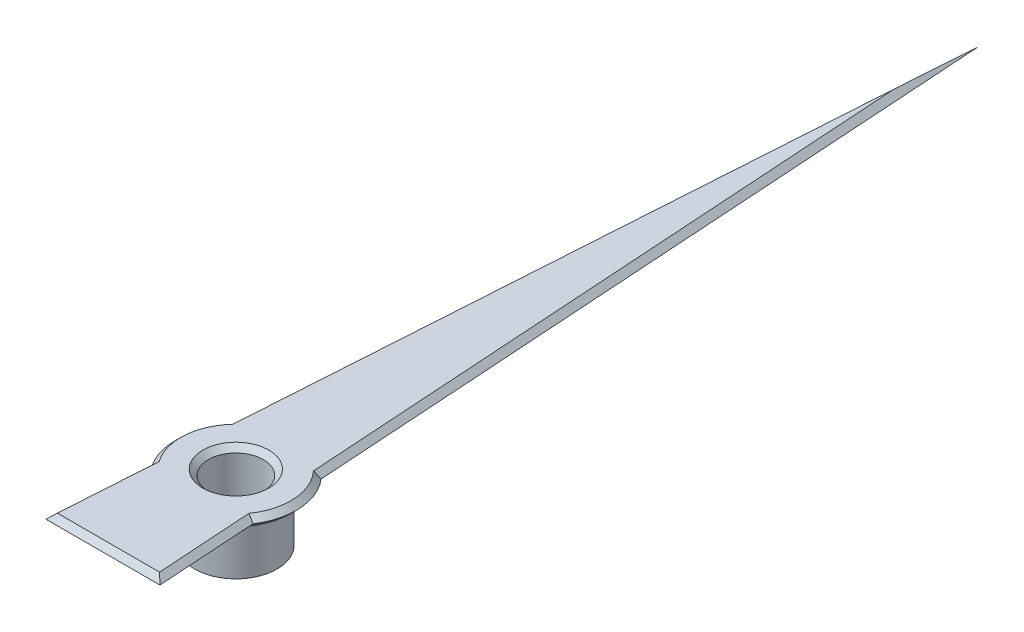
ISO-10303-21;
HEADER;
FILE_DESCRIPTION(('STEP AP214'),'2;1');
FILE_NAME('part.step','',(''),(''),'','','');
FILE_SCHEMA(('AUTOMOTIVE_DESIGN { 1 0 10303 214 1 1 1 1 }'));
ENDSEC;
DATA;
#1=APPLICATION_CONTEXT('core data for automotive mechanical design processes');
#2=APPLICATION_PROTOCOL_DEFINITION('international standard','automotive_design',2000,#1);
#3=PRODUCT_CONTEXT('',#1,'mechanical');
#4=PRODUCT('Part','Part','',(#3));
#5=PRODUCT_RELATED_PRODUCT_CATEGORY('part','',(#4));
#6=PRODUCT_DEFINITION_FORMATION('','',#4);
#7=PRODUCT_DEFINITION_CONTEXT('part definition',#1,'design');
#8=PRODUCT_DEFINITION('design','',#6,#7);
#9=PRODUCT_DEFINITION_SHAPE('','',#8);
#10=(LENGTH_UNIT() NAMED_UNIT(*) SI_UNIT(.MILLI.,.METRE.));
#11=(NAMED_UNIT(*) PLANE_ANGLE_UNIT() SI_UNIT($,.RADIAN.));
#12=(NAMED_UNIT(*) SI_UNIT($,.STERADIAN.) SOLID_ANGLE_UNIT());
#13=UNCERTAINTY_MEASURE_WITH_UNIT(LENGTH_MEASURE(1.E-05),#10,'distance_accuracy_value','');
#14=(GEOMETRIC_REPRESENTATION_CONTEXT(3) GLOBAL_UNCERTAINTY_ASSIGNED_CONTEXT((#13)) GLOBAL_UNIT_ASSIGNED_CONTEXT((#10,
#11,#12)) REPRESENTATION_CONTEXT('',''));
#15=CARTESIAN_POINT('',(0.,0.,0.));
#16=DIRECTION('',(0.,0.,1.));
#17=DIRECTION('',(1.,0.,0.));
#18=AXIS2_PLACEMENT_3D('',#15,#16,#17);
#19=CARTESIAN_POINT('',(0.,-1.,0.));
#20=DIRECTION('',(0.,1.,0.));
#21=DIRECTION('',(0.,0.,1.));
#22=AXIS2_PLACEMENT_3D('',#19,#20,#21);
#23=CYLINDRICAL_SURFACE('',#22,0.75);
#24=CARTESIAN_POINT('',(0.,-0.1,0.));
#25=DIRECTION('',(0.,1.,0.));
#26=DIRECTION('',(0.,0.,1.));
#27=AXIS2_PLACEMENT_3D('',#24,#25,#26);
#28=CIRCLE('',#27,0.75);
#29=CARTESIAN_POINT('',(0.,-0.1,0.75));
#30=VERTEX_POINT('',#29);
#31=EDGE_CURVE('E304',#30,#30,#28,.F.);
#32=ORIENTED_EDGE('',*,*,#31,.T.);
#33=EDGE_LOOP('',(#32));
#34=FACE_BOUND('',#33,.T.);
#35=CARTESIAN_POINT('',(0.,-1.,0.));
#36=DIRECTION('',(0.,1.,0.));
#37=DIRECTION('',(0.,0.,1.));
#38=AXIS2_PLACEMENT_3D('',#35,#36,#37);
#39=CIRCLE('',#38,0.75);
#40=CARTESIAN_POINT('',(0.,-1.,0.75));
#41=VERTEX_POINT('',#40);
#42=EDGE_CURVE('E327',#41,#41,#39,.T.);
#43=ORIENTED_EDGE('',*,*,#42,.T.);
#44=EDGE_LOOP('',(#43));
#45=FACE_BOUND('',#44,.T.);
#46=ADVANCED_FACE('F34',(#34,#45),#23,.T.);
#47=CARTESIAN_POINT('',(0.,-1.,0.));
#48=DIRECTION('',(0.,1.,0.));
#49=DIRECTION('',(0.,0.,1.));
#50=AXIS2_PLACEMENT_3D('',#47,#48,#49);
#51=PLANE('',#50);
#52=ORIENTED_EDGE('',*,*,#42,.F.);
#53=EDGE_LOOP('',(#52));
#54=FACE_BOUND('',#53,.T.);
#55=ADVANCED_FACE('F178',(#54),#51,.F.);
#56=CARTESIAN_POINT('',(0.,0.2,0.));
#57=DIRECTION('',(0.,1.,0.));
#58=DIRECTION('',(0.,0.,1.));
#59=AXIS2_PLACEMENT_3D('',#56,#57,#58);
#60=PLANE('',#59);
#61=DIRECTION('',(-0.0649705239479234,0.,-0.997887183512211));
#62=VECTOR('',#61,1.);
#63=CARTESIAN_POINT('',(0.77546019922381,0.2,-0.0504887288631216));
#64=LINE('',#63,#62);
#65=CARTESIAN_POINT('',(0.734569402706049,0.2,-0.678533560413986));
#66=VERTEX_POINT('',#65);
#67=CARTESIAN_POINT('',(0.,0.2,-11.9608404869853));
#68=VERTEX_POINT('',#67);
#69=EDGE_CURVE('E57',#66,#68,#64,.T.);
#70=ORIENTED_EDGE('',*,*,#69,.T.);
#71=DIRECTION('',(-0.0649705239479234,0.,0.997887183512211));
#72=VECTOR('',#71,1.);
#73=CARTESIAN_POINT('',(-0.77546019922381,0.2,-0.0504887288631216));
#74=LINE('',#73,#72);
#75=CARTESIAN_POINT('',(-0.734569402706049,0.2,-0.678533560413986));
#76=VERTEX_POINT('',#75);
#77=EDGE_CURVE('E48',#68,#76,#74,.T.);
#78=ORIENTED_EDGE('',*,*,#77,.T.);
#79=CARTESIAN_POINT('',(0.,0.2,0.));
#80=DIRECTION('',(0.,1.,0.));
#81=DIRECTION('',(0.,0.,1.));
#82=AXIS2_PLACEMENT_3D('',#79,#80,#81);
#83=CIRCLE('',#82,1.);
#84=CARTESIAN_POINT('',(-0.816350995741502,0.2,0.577556102687748));
#85=VERTEX_POINT('',#84);
#86=EDGE_CURVE('E309',#76,#85,#83,.T.);
#87=ORIENTED_EDGE('',*,*,#86,.T.);
#88=DIRECTION('',(-0.0649705239479234,0.,0.997887183512211));
#89=VECTOR('',#88,1.);
#90=CARTESIAN_POINT('',(-0.77546019922381,0.2,-0.0504887288631216));
#91=LINE('',#90,#89);
#92=CARTESIAN_POINT('',(-0.92957833560792,0.2,2.31662336596562));
#93=VERTEX_POINT('',#92);
#94=EDGE_CURVE('E311',#85,#93,#91,.T.);
#95=ORIENTED_EDGE('',*,*,#94,.T.);
#96=DIRECTION('',(1.,0.,0.));
#97=VECTOR('',#96,1.);
#98=CARTESIAN_POINT('',(0.,0.2,2.31662336596562));
#99=LINE('',#98,#97);
#100=CARTESIAN_POINT('',(0.92957833560792,0.2,2.31662336596562));
#101=VERTEX_POINT('',#100);
#102=EDGE_CURVE('E132',#93,#101,#99,.T.);
#103=ORIENTED_EDGE('',*,*,#102,.T.);
#104=DIRECTION('',(-0.0649705239479234,0.,-0.997887183512211));
#105=VECTOR('',#104,1.);
#106=CARTESIAN_POINT('',(0.77546019922381,0.2,-0.0504887288631216));
#107=LINE('',#106,#105);
#108=CARTESIAN_POINT('',(0.816350995741537,0.2,0.577556102687746));
#109=VERTEX_POINT('',#108);
#110=EDGE_CURVE('E126',#101,#109,#107,.T.);
#111=ORIENTED_EDGE('',*,*,#110,.T.);
#112=CARTESIAN_POINT('',(0.,0.2,0.));
#113=DIRECTION('',(0.,1.,0.));
#114=DIRECTION('',(0.,0.,1.));
#115=AXIS2_PLACEMENT_3D('',#112,#113,#114);
#116=CIRCLE('',#115,1.);
#117=EDGE_CURVE('E130',#109,#66,#116,.T.);
#118=ORIENTED_EDGE('',*,*,#117,.T.);
#119=EDGE_LOOP('',(#70,#78,#87,#95,#103,#111,#118));
#120=FACE_BOUND('',#119,.T.);
#121=CARTESIAN_POINT('',(0.,0.2,0.));
#122=DIRECTION('',(0.,1.,0.));
#123=DIRECTION('',(0.,0.,1.));
#124=AXIS2_PLACEMENT_3D('',#121,#122,#123);
#125=CIRCLE('',#124,0.600000000000005);
#126=CARTESIAN_POINT('',(0.,0.2,0.600000000000005));
#127=VERTEX_POINT('',#126);
#128=EDGE_CURVE('E306',#127,#127,#125,.F.);
#129=ORIENTED_EDGE('',*,*,#128,.T.);
#130=EDGE_LOOP('',(#129));
#131=FACE_BOUND('',#130,.T.);
#132=ADVANCED_FACE('F128',(#120,#131),#60,.T.);
#133=CARTESIAN_POINT('',(0.,0.,0.));
#134=DIRECTION('',(0.,1.,0.));
#135=DIRECTION('',(0.,0.,1.));
#136=AXIS2_PLACEMENT_3D('',#133,#134,#135);
#137=PLANE('',#136);
#138=CARTESIAN_POINT('',(0.,0.,0.));
#139=DIRECTION('',(0.,1.,0.));
#140=DIRECTION('',(0.,0.,1.));
#141=AXIS2_PLACEMENT_3D('',#138,#139,#140);
#142=CIRCLE('',#141,0.850000000000002);
#143=CARTESIAN_POINT('',(0.,0.,0.850000000000002));
#144=VERTEX_POINT('',#143);
#145=EDGE_CURVE('E301',#144,#144,#142,.T.);
#146=ORIENTED_EDGE('',*,*,#145,.T.);
#147=EDGE_LOOP('',(#146));
#148=FACE_BOUND('',#147,.T.);
#149=DIRECTION('',(-1.,0.,0.));
#150=VECTOR('',#149,1.);
#151=CARTESIAN_POINT('',(-1.03630087313963,0.,2.31662336596562));
#152=LINE('',#151,#150);
#153=CARTESIAN_POINT('',(0.929578335607919,0.,2.31662336596562));
#154=VERTEX_POINT('',#153);
#155=CARTESIAN_POINT('',(-0.929578335607919,0.,2.31662336596562));
#156=VERTEX_POINT('',#155);
#157=EDGE_CURVE('E286',#154,#156,#152,.T.);
#158=ORIENTED_EDGE('',*,*,#157,.T.);
#159=DIRECTION('',(0.0649705239479234,0.,-0.997887183512211));
#160=VECTOR('',#159,1.);
#161=CARTESIAN_POINT('',(-0.818590643259629,0.,0.611955018043307));
#162=LINE('',#161,#160);
#163=CARTESIAN_POINT('',(-0.816350995741501,0.,0.577556102687747));
#164=VERTEX_POINT('',#163);
#165=EDGE_CURVE('E293',#156,#164,#162,.T.);
#166=ORIENTED_EDGE('',*,*,#165,.T.);
#167=CARTESIAN_POINT('',(0.,0.,0.));
#168=DIRECTION('',(0.,1.,0.));
#169=DIRECTION('',(0.,0.,1.));
#170=AXIS2_PLACEMENT_3D('',#167,#168,#169);
#171=CIRCLE('',#170,1.);
#172=CARTESIAN_POINT('',(-0.734569402706048,0.,-0.678533560413986));
#173=VERTEX_POINT('',#172);
#174=EDGE_CURVE('E323',#164,#173,#171,.F.);
#175=ORIENTED_EDGE('',*,*,#174,.T.);
#176=DIRECTION('',(0.0649705239479234,0.,-0.997887183512211));
#177=VECTOR('',#176,1.);
#178=CARTESIAN_POINT('',(0.0997887183512213,0.,-13.4935029476052));
#179=LINE('',#178,#177);
#180=CARTESIAN_POINT('',(0.,0.,-11.9608404869852));
#181=VERTEX_POINT('',#180);
#182=EDGE_CURVE('E326',#173,#181,#179,.T.);
#183=ORIENTED_EDGE('',*,*,#182,.T.);
#184=DIRECTION('',(0.0649705239479234,0.,0.997887183512211));
#185=VECTOR('',#184,1.);
#186=CARTESIAN_POINT('',(0.732329755187987,0.,-0.712932475769563));
#187=LINE('',#186,#185);
#188=CARTESIAN_POINT('',(0.734569402706082,0.,-0.678533560413988));
#189=VERTEX_POINT('',#188);
#190=EDGE_CURVE('E295',#181,#189,#187,.T.);
#191=ORIENTED_EDGE('',*,*,#190,.T.);
#192=CARTESIAN_POINT('',(0.,0.,0.));
#193=DIRECTION('',(0.,1.,0.));
#194=DIRECTION('',(0.,0.,1.));
#195=AXIS2_PLACEMENT_3D('',#192,#193,#194);
#196=CIRCLE('',#195,1.);
#197=CARTESIAN_POINT('',(0.816350995741501,0.,0.577556102687747));
#198=VERTEX_POINT('',#197);
#199=EDGE_CURVE('E291',#189,#198,#196,.F.);
#200=ORIENTED_EDGE('',*,*,#199,.T.);
#201=DIRECTION('',(0.0649705239479234,0.,0.997887183512211));
#202=VECTOR('',#201,1.);
#203=CARTESIAN_POINT('',(0.936512154788406,0.,2.42312041836042));
#204=LINE('',#203,#202);
#205=EDGE_CURVE('E288',#198,#154,#204,.T.);
#206=ORIENTED_EDGE('',*,*,#205,.T.);
#207=EDGE_LOOP('',(#158,#166,#175,#183,#191,#200,#206));
#208=FACE_BOUND('',#207,.T.);
#209=ADVANCED_FACE('F329',(#148,#208),#137,.F.);
#210=CARTESIAN_POINT('',(0.,-0.8,0.));
#211=DIRECTION('',(0.,1.,0.));
#212=DIRECTION('',(0.,0.,1.));
#213=AXIS2_PLACEMENT_3D('',#210,#211,#212);
#214=CYLINDRICAL_SURFACE('',#213,0.5);
#215=CARTESIAN_POINT('',(0.,0.0999999999999967,0.));
#216=DIRECTION('',(0.,1.,0.));
#217=DIRECTION('',(0.,0.,1.));
#218=AXIS2_PLACEMENT_3D('',#215,#216,#217);
#219=CIRCLE('',#218,0.5);
#220=CARTESIAN_POINT('',(0.,0.0999999999999967,0.5));
#221=VERTEX_POINT('',#220);
#222=EDGE_CURVE('E11',#221,#221,#219,.T.);
#223=ORIENTED_EDGE('',*,*,#222,.T.);
#224=EDGE_LOOP('',(#223));
#225=FACE_BOUND('',#224,.T.);
#226=CARTESIAN_POINT('',(0.,-0.8,0.));
#227=DIRECTION('',(0.,1.,0.));
#228=DIRECTION('',(0.,0.,1.));
#229=AXIS2_PLACEMENT_3D('',#226,#227,#228);
#230=CIRCLE('',#229,0.5);
#231=CARTESIAN_POINT('',(0.,-0.8,0.5));
#232=VERTEX_POINT('',#231);
#233=EDGE_CURVE('E347',#232,#232,#230,.T.);
#234=ORIENTED_EDGE('',*,*,#233,.F.);
#235=EDGE_LOOP('',(#234));
#236=FACE_BOUND('',#235,.T.);
#237=ADVANCED_FACE('F331',(#225,#236),#214,.F.);
#238=CARTESIAN_POINT('',(0.,-0.8,0.));
#239=DIRECTION('',(0.,1.,0.));
#240=DIRECTION('',(0.,0.,1.));
#241=AXIS2_PLACEMENT_3D('',#238,#239,#240);
#242=PLANE('',#241);
#243=ORIENTED_EDGE('',*,*,#233,.T.);
#244=EDGE_LOOP('',(#243));
#245=FACE_BOUND('',#244,.T.);
#246=ADVANCED_FACE('F174',(#245),#242,.T.);
#247=CARTESIAN_POINT('',(0.,0.,0.));
#248=DIRECTION('',(0.,1.,0.));
#249=DIRECTION('',(0.,0.,1.));
#250=AXIS2_PLACEMENT_3D('',#247,#248,#249);
#251=CONICAL_SURFACE('',#250,0.850000000000002,0.785398163397455);
#252=ORIENTED_EDGE('',*,*,#31,.F.);
#253=EDGE_LOOP('',(#252));
#254=FACE_BOUND('',#253,.T.);
#255=ORIENTED_EDGE('',*,*,#145,.F.);
#256=EDGE_LOOP('',(#255));
#257=FACE_BOUND('',#256,.T.);
#258=ADVANCED_FACE('F168',(#254,#257),#251,.T.);
#259=CARTESIAN_POINT('',(0.77546019922381,0.2,-0.0504887288631216));
#260=DIRECTION('',(-0.705612794320632,-0.707106781186544,0.0459410980608198));
#261=DIRECTION('',(0.707854168766259,-0.706358602807546,0.));
#262=AXIS2_PLACEMENT_3D('',#259,#260,#261);
#263=PLANE('',#262);
#264=DIRECTION('',(0.,0.0648338307695518,0.997896073941443));
#265=VECTOR('',#264,1.);
#266=CARTESIAN_POINT('',(0.,0.970569091780508,-0.100553006494177));
#267=LINE('',#266,#265);
#268=CARTESIAN_POINT('',(0.,0.100000000000001,-13.5));
#269=VERTEX_POINT('',#268);
#270=EDGE_CURVE('E148',#68,#269,#267,.F.);
#271=ORIENTED_EDGE('',*,*,#270,.F.);
#272=ORIENTED_EDGE('',*,*,#69,.F.);
#273=CARTESIAN_POINT('',(0.832118473539209,0.1,-0.719429528164349));
#274=CARTESIAN_POINT('',(0.815826053026441,0.116691570761109,-0.712756145887584));
#275=CARTESIAN_POINT('',(0.799550757166332,0.133370685749081,-0.706011458994636));
#276=CARTESIAN_POINT('',(0.767034400191282,0.166704019104725,-0.692379469872252));
#277=CARTESIAN_POINT('',(0.750793339107012,0.183358237450089,-0.685492167515101));
#278=CARTESIAN_POINT('',(0.734569402706073,0.200000000000006,-0.678533560414052));
#279=B_SPLINE_CURVE_WITH_KNOTS('',3,(#273,#274,#275,#276,#277,#278),.UNSPECIFIED.,.F.,.F.,(4,2,
4),(0.,0.0727813190358586,0.145562703251685),.UNSPECIFIED.);
#280=CARTESIAN_POINT('',(0.832118473539209,0.100000000000001,-0.719429528164349));
#281=VERTEX_POINT('',#280);
#282=EDGE_CURVE('E38',#281,#66,#279,.T.);
#283=ORIENTED_EDGE('',*,*,#282,.F.);
#284=DIRECTION('',(0.0649705239479234,0.,0.997887183512211));
#285=VECTOR('',#284,1.);
#286=CARTESIAN_POINT('',(0.,0.1,-13.5));
#287=LINE('',#286,#285);
#288=EDGE_CURVE('E82',#269,#281,#287,.T.);
#289=ORIENTED_EDGE('',*,*,#288,.F.);
#290=EDGE_LOOP('',(#271,#272,#283,#289));
#291=FACE_BOUND('',#290,.T.);
#292=ADVANCED_FACE('F165',(#291),#263,.F.);
#293=CARTESIAN_POINT('',(0.,0.2,0.));
#294=DIRECTION('',(0.,-1.,0.));
#295=DIRECTION('',(0.,0.,-1.));
#296=AXIS2_PLACEMENT_3D('',#293,#294,#295);
#297=CONICAL_SURFACE('',#296,1.,0.785398163397444);
#298=ORIENTED_EDGE('',*,*,#282,.T.);
#299=ORIENTED_EDGE('',*,*,#117,.F.);
#300=CARTESIAN_POINT('',(0.918379361610851,0.1,0.605457965648521));
#301=CARTESIAN_POINT('',(0.90135917305322,0.116691570761113,0.600953503567481));
#302=CARTESIAN_POINT('',(0.88434671875568,0.133370685749087,0.596376118354045));
#303=CARTESIAN_POINT('',(0.850337263452048,0.166704019104739,0.587075497497753));
#304=CARTESIAN_POINT('',(0.833340262459809,0.183358237450107,0.582352261724284));
#305=CARTESIAN_POINT('',(0.816350995741514,0.200000000000027,0.577556102687804));
#306=B_SPLINE_CURVE_WITH_KNOTS('',3,(#300,#301,#302,#303,#304,#305),.UNSPECIFIED.,.F.,.F.,(4,2,
4),(0.,0.0727813190358737,0.145562703251715),.UNSPECIFIED.);
#307=CARTESIAN_POINT('',(0.918379361610851,0.100000000000001,0.605457965648521));
#308=VERTEX_POINT('',#307);
#309=EDGE_CURVE('E140',#308,#109,#306,.T.);
#310=ORIENTED_EDGE('',*,*,#309,.F.);
#311=CARTESIAN_POINT('',(0.,0.1,0.));
#312=DIRECTION('',(0.,1.,0.));
#313=DIRECTION('',(0.,0.,1.));
#314=AXIS2_PLACEMENT_3D('',#311,#312,#313);
#315=CIRCLE('',#314,1.1);
#316=EDGE_CURVE('E149',#281,#308,#315,.F.);
#317=ORIENTED_EDGE('',*,*,#316,.F.);
#318=EDGE_LOOP('',(#298,#299,#310,#317));
#319=FACE_BOUND('',#318,.T.);
#320=ADVANCED_FACE('F138',(#319),#297,.T.);
#321=CARTESIAN_POINT('',(0.,0.100000000000001,-13.5));
#322=DIRECTION('',(0.70561279432063,-0.707106781186546,-0.0459410980608197));
#323=DIRECTION('',(0.707854168766261,0.706358602807544,0.));
#324=AXIS2_PLACEMENT_3D('',#321,#322,#323);
#325=PLANE('',#324);
#326=DIRECTION('',(0.,-0.0648338307695515,0.997896073941443));
#327=VECTOR('',#326,1.);
#328=CARTESIAN_POINT('',(0.,0.100000000000001,-13.5));
#329=LINE('',#328,#327);
#330=EDGE_CURVE('E262',#269,#181,#329,.T.);
#331=ORIENTED_EDGE('',*,*,#330,.F.);
#332=ORIENTED_EDGE('',*,*,#288,.T.);
#333=CARTESIAN_POINT('',(0.832118473539209,0.100000000000001,-0.719429528164349));
#334=CARTESIAN_POINT('',(0.815826053026437,0.0833084292388882,-0.712756145887582));
#335=CARTESIAN_POINT('',(0.799550757166325,0.0666293142509133,-0.706011458994633));
#336=CARTESIAN_POINT('',(0.767034400191267,0.033295980895261,-0.692379469872246));
#337=CARTESIAN_POINT('',(0.750793339106994,0.0166417625498936,-0.685492167515093));
#338=CARTESIAN_POINT('',(0.734569402706052,0.,-0.678533560414043));
#339=B_SPLINE_CURVE_WITH_KNOTS('',3,(#333,#334,#335,#336,#337,#338),.UNSPECIFIED.,.F.,.F.,(4,2,
4),(0.,0.0727813190358746,0.145562703251717),.UNSPECIFIED.);
#340=EDGE_CURVE('E152',#189,#281,#339,.F.);
#341=ORIENTED_EDGE('',*,*,#340,.F.);
#342=ORIENTED_EDGE('',*,*,#190,.F.);
#343=EDGE_LOOP('',(#331,#332,#341,#342));
#344=FACE_BOUND('',#343,.T.);
#345=ADVANCED_FACE('F173',(#344),#325,.T.);
#346=CARTESIAN_POINT('',(-0.77546019922381,0.2,-0.0504887288631216));
#347=DIRECTION('',(0.705612794320632,-0.707106781186544,0.0459410980608198));
#348=DIRECTION('',(0.707854168766259,0.706358602807546,0.));
#349=AXIS2_PLACEMENT_3D('',#346,#347,#348);
#350=PLANE('',#349);
#351=ORIENTED_EDGE('',*,*,#77,.F.);
#352=ORIENTED_EDGE('',*,*,#270,.T.);
#353=DIRECTION('',(0.0649705239479234,0.,-0.997887183512211));
#354=VECTOR('',#353,1.);
#355=CARTESIAN_POINT('',(0.,0.1,-13.5));
#356=LINE('',#355,#354);
#357=CARTESIAN_POINT('',(-0.832118473539209,0.100000000000001,-0.719429528164349));
#358=VERTEX_POINT('',#357);
#359=EDGE_CURVE('E246',#358,#269,#356,.T.);
#360=ORIENTED_EDGE('',*,*,#359,.F.);
#361=CARTESIAN_POINT('',(-0.734569402706082,0.2,-0.678533560414016));
#362=CARTESIAN_POINT('',(-0.750793339107021,0.183358237450083,-0.685492167515063));
#363=CARTESIAN_POINT('',(-0.767034400191287,0.166704019104721,-0.692379469872226));
#364=CARTESIAN_POINT('',(-0.799550757166326,0.133370685749086,-0.706011458994662));
#365=CARTESIAN_POINT('',(-0.815826053026425,0.116691570761121,-0.71275614588765));
#366=CARTESIAN_POINT('',(-0.832118473539179,0.100000000000022,-0.719429528164469));
#367=B_SPLINE_CURVE_WITH_KNOTS('',3,(#361,#362,#363,#364,#365,#366),.UNSPECIFIED.,.F.,.F.,(4,2,
4),(0.,0.0727813842158262,0.145562703251684),.UNSPECIFIED.);
#368=EDGE_CURVE('E238',#76,#358,#367,.T.);
#369=ORIENTED_EDGE('',*,*,#368,.F.);
#370=EDGE_LOOP('',(#351,#352,#360,#369));
#371=FACE_BOUND('',#370,.T.);
#372=ADVANCED_FACE('F164',(#371),#350,.F.);
#373=CARTESIAN_POINT('',(0.77546019922381,0.2,-0.0504887288631215));
#374=DIRECTION('',(-0.705612794320632,-0.707106781186545,0.0459410980608198));
#375=DIRECTION('',(0.70785416876626,-0.706358602807545,0.));
#376=AXIS2_PLACEMENT_3D('',#373,#374,#375);
#377=PLANE('',#376);
#378=ORIENTED_EDGE('',*,*,#309,.T.);
#379=ORIENTED_EDGE('',*,*,#110,.F.);
#380=DIRECTION('',(-0.602368926162997,0.564425228348823,-0.564425228348819));
#381=VECTOR('',#380,1.);
#382=CARTESIAN_POINT('',(0.592282395243253,0.51604940077859,2.00057396518704));
#383=LINE('',#382,#381);
#384=CARTESIAN_POINT('',(1.03630087313963,0.100000000000001,2.41662336596562));
#385=VERTEX_POINT('',#384);
#386=EDGE_CURVE('E247',#385,#101,#383,.T.);
#387=ORIENTED_EDGE('',*,*,#386,.F.);
#388=DIRECTION('',(0.0649705239479234,0.,0.997887183512211));
#389=VECTOR('',#388,1.);
#390=CARTESIAN_POINT('',(0.,0.1,-13.5));
#391=LINE('',#390,#389);
#392=EDGE_CURVE('E146',#308,#385,#391,.T.);
#393=ORIENTED_EDGE('',*,*,#392,.F.);
#394=EDGE_LOOP('',(#378,#379,#387,#393));
#395=FACE_BOUND('',#394,.T.);
#396=ADVANCED_FACE('F144',(#395),#377,.F.);
#397=CARTESIAN_POINT('',(0.,0.100000000000001,0.));
#398=DIRECTION('',(0.,1.,0.));
#399=DIRECTION('',(0.,0.,1.));
#400=AXIS2_PLACEMENT_3D('',#397,#398,#399);
#401=CONICAL_SURFACE('',#400,1.1,0.785398163397446);
#402=ORIENTED_EDGE('',*,*,#340,.T.);
#403=ORIENTED_EDGE('',*,*,#316,.T.);
#404=CARTESIAN_POINT('',(0.918379361610851,0.100000000000001,0.605457965648521));
#405=CARTESIAN_POINT('',(0.901359173053224,0.0833084292388917,0.600953503567482));
#406=CARTESIAN_POINT('',(0.884346718755686,0.0666293142509202,0.596376118354047));
#407=CARTESIAN_POINT('',(0.850337263452061,0.0332959808952748,0.587075497497756));
#408=CARTESIAN_POINT('',(0.833340262459826,0.0166417625499108,0.582352261724288));
#409=CARTESIAN_POINT('',(0.816350995741533,0.,0.577556102687809));
#410=B_SPLINE_CURVE_WITH_KNOTS('',3,(#404,#405,#406,#407,#408,#409),.UNSPECIFIED.,.F.,.F.,(4,2,
4),(0.,0.0727813190358595,0.145562703251687),.UNSPECIFIED.);
#411=EDGE_CURVE('E270',#198,#308,#410,.F.);
#412=ORIENTED_EDGE('',*,*,#411,.F.);
#413=ORIENTED_EDGE('',*,*,#199,.F.);
#414=EDGE_LOOP('',(#402,#403,#412,#413));
#415=FACE_BOUND('',#414,.T.);
#416=ADVANCED_FACE('F163',(#415),#401,.T.);
#417=CARTESIAN_POINT('',(0.,0.100000000000001,-13.5));
#418=DIRECTION('',(-0.70561279432063,-0.707106781186546,-0.0459410980608197));
#419=DIRECTION('',(0.707854168766261,-0.706358602807544,0.));
#420=AXIS2_PLACEMENT_3D('',#417,#418,#419);
#421=PLANE('',#420);
#422=ORIENTED_EDGE('',*,*,#330,.T.);
#423=ORIENTED_EDGE('',*,*,#182,.F.);
#424=CARTESIAN_POINT('',(-0.832118473539209,0.100000000000001,-0.719429528164349));
#425=CARTESIAN_POINT('',(-0.815826053026441,0.0833084292388917,-0.712756145887583));
#426=CARTESIAN_POINT('',(-0.799550757166332,0.0666293142509202,-0.706011458994635));
#427=CARTESIAN_POINT('',(-0.767034400191281,0.0332959808952748,-0.692379469872251));
#428=CARTESIAN_POINT('',(-0.750793339107011,0.0166417625499107,-0.6854921675151));
#429=CARTESIAN_POINT('',(-0.734569402706072,0.,-0.678533560414051));
#430=B_SPLINE_CURVE_WITH_KNOTS('',3,(#424,#425,#426,#427,#428,#429),.UNSPECIFIED.,.F.,.F.,(4,2,
4),(0.,0.0727813190358595,0.145562703251687),.UNSPECIFIED.);
#431=EDGE_CURVE('E274',#358,#173,#430,.T.);
#432=ORIENTED_EDGE('',*,*,#431,.F.);
#433=ORIENTED_EDGE('',*,*,#359,.T.);
#434=EDGE_LOOP('',(#422,#423,#432,#433));
#435=FACE_BOUND('',#434,.T.);
#436=ADVANCED_FACE('F232',(#435),#421,.T.);
#437=CARTESIAN_POINT('',(0.,0.2,0.));
#438=DIRECTION('',(0.,-1.,0.));
#439=DIRECTION('',(0.,0.,-1.));
#440=AXIS2_PLACEMENT_3D('',#437,#438,#439);
#441=CONICAL_SURFACE('',#440,1.,0.785398163397444);
#442=ORIENTED_EDGE('',*,*,#86,.F.);
#443=ORIENTED_EDGE('',*,*,#368,.T.);
#444=CARTESIAN_POINT('',(0.,0.1,0.));
#445=DIRECTION('',(0.,1.,0.));
#446=DIRECTION('',(0.,0.,1.));
#447=AXIS2_PLACEMENT_3D('',#444,#445,#446);
#448=CIRCLE('',#447,1.1);
#449=CARTESIAN_POINT('',(-0.918379361610851,0.100000000000001,0.605457965648521));
#450=VERTEX_POINT('',#449);
#451=EDGE_CURVE('E223',#450,#358,#448,.F.);
#452=ORIENTED_EDGE('',*,*,#451,.F.);
#453=CARTESIAN_POINT('',(-0.918379361610851,0.1,0.605457965648521));
#454=CARTESIAN_POINT('',(-0.901359173053224,0.116691570761109,0.600953503567482));
#455=CARTESIAN_POINT('',(-0.884346718755687,0.133370685749081,0.596376118354047));
#456=CARTESIAN_POINT('',(-0.850337263452062,0.166704019104726,0.587075497497757));
#457=CARTESIAN_POINT('',(-0.833340262459827,0.183358237450089,0.582352261724289));
#458=CARTESIAN_POINT('',(-0.816350995741535,0.200000000000006,0.57755610268781));
#459=B_SPLINE_CURVE_WITH_KNOTS('',3,(#453,#454,#455,#456,#457,#458),.UNSPECIFIED.,.F.,.F.,(4,2,
4),(0.,0.0727813190358586,0.145562703251685),.UNSPECIFIED.);
#460=EDGE_CURVE('E215',#85,#450,#459,.F.);
#461=ORIENTED_EDGE('',*,*,#460,.F.);
#462=EDGE_LOOP('',(#442,#443,#452,#461));
#463=FACE_BOUND('',#462,.T.);
#464=ADVANCED_FACE('F227',(#463),#441,.T.);
#465=CARTESIAN_POINT('',(0.,0.2,2.31662336596562));
#466=DIRECTION('',(0.,-0.707106781186545,-0.70710678118655));
#467=DIRECTION('',(0.,0.70710678118655,-0.707106781186545));
#468=AXIS2_PLACEMENT_3D('',#465,#466,#467);
#469=PLANE('',#468);
#470=ORIENTED_EDGE('',*,*,#386,.T.);
#471=ORIENTED_EDGE('',*,*,#102,.F.);
#472=DIRECTION('',(0.602368926162997,0.564425228348823,-0.56442522834882));
#473=VECTOR('',#472,1.);
#474=CARTESIAN_POINT('',(-0.0688571352132794,1.00650368731995,1.51011967864567));
#475=LINE('',#474,#473);
#476=CARTESIAN_POINT('',(-1.03630087313963,0.100000000000001,2.41662336596562));
#477=VERTEX_POINT('',#476);
#478=EDGE_CURVE('E212',#477,#93,#475,.T.);
#479=ORIENTED_EDGE('',*,*,#478,.F.);
#480=DIRECTION('',(-1.,0.,0.));
#481=VECTOR('',#480,1.);
#482=CARTESIAN_POINT('',(-1.03630087313963,0.1,2.41662336596562));
#483=LINE('',#482,#481);
#484=EDGE_CURVE('E209',#385,#477,#483,.T.);
#485=ORIENTED_EDGE('',*,*,#484,.F.);
#486=EDGE_LOOP('',(#470,#471,#479,#485));
#487=FACE_BOUND('',#486,.T.);
#488=ADVANCED_FACE('F231',(#487),#469,.F.);
#489=CARTESIAN_POINT('',(0.,0.100000000000001,-13.5));
#490=DIRECTION('',(0.70561279432063,-0.707106781186546,-0.0459410980608197));
#491=DIRECTION('',(0.707854168766261,0.706358602807544,0.));
#492=AXIS2_PLACEMENT_3D('',#489,#490,#491);
#493=PLANE('',#492);
#494=ORIENTED_EDGE('',*,*,#411,.T.);
#495=ORIENTED_EDGE('',*,*,#392,.T.);
#496=DIRECTION('',(-0.602368926162998,-0.564425228348822,-0.564425228348819));
#497=VECTOR('',#496,1.);
#498=CARTESIAN_POINT('',(-4.75124725342026,-5.32298586635497,-3.00636250038932));
#499=LINE('',#498,#497);
#500=EDGE_CURVE('E204',#154,#385,#499,.F.);
#501=ORIENTED_EDGE('',*,*,#500,.F.);
#502=ORIENTED_EDGE('',*,*,#205,.F.);
#503=EDGE_LOOP('',(#494,#495,#501,#502));
#504=FACE_BOUND('',#503,.T.);
#505=ADVANCED_FACE('F266',(#504),#493,.T.);
#506=CARTESIAN_POINT('',(0.,0.100000000000001,0.));
#507=DIRECTION('',(0.,1.,0.));
#508=DIRECTION('',(0.,0.,1.));
#509=AXIS2_PLACEMENT_3D('',#506,#507,#508);
#510=CONICAL_SURFACE('',#509,1.1,0.785398163397446);
#511=ORIENTED_EDGE('',*,*,#431,.T.);
#512=ORIENTED_EDGE('',*,*,#174,.F.);
#513=CARTESIAN_POINT('',(-0.816350995741537,0.,0.577556102687773));
#514=CARTESIAN_POINT('',(-0.83334026245983,0.0166417625499172,0.58235226172425));
#515=CARTESIAN_POINT('',(-0.850337263452063,0.0332959808952791,0.58707549749773));
#516=CARTESIAN_POINT('',(-0.884346718755683,0.0666293142509152,0.596376118354073));
#517=CARTESIAN_POINT('',(-0.901359173053216,0.0833084292388796,0.60095350356755));
#518=CARTESIAN_POINT('',(-0.918379361610837,0.0999999999999789,0.605457965648644));
#519=B_SPLINE_CURVE_WITH_KNOTS('',3,(#513,#514,#515,#516,#517,#518),.UNSPECIFIED.,.F.,.F.,(4,2,
4),(0.,0.072781384215827,0.145562703251686),.UNSPECIFIED.);
#520=EDGE_CURVE('E93',#450,#164,#519,.F.);
#521=ORIENTED_EDGE('',*,*,#520,.F.);
#522=ORIENTED_EDGE('',*,*,#451,.T.);
#523=EDGE_LOOP('',(#511,#512,#521,#522));
#524=FACE_BOUND('',#523,.T.);
#525=ADVANCED_FACE('F195',(#524),#510,.T.);
#526=CARTESIAN_POINT('',(-0.77546019922381,0.2,-0.0504887288631216));
#527=DIRECTION('',(0.705612794320632,-0.707106781186544,0.0459410980608198));
#528=DIRECTION('',(0.707854168766259,0.706358602807546,0.));
#529=AXIS2_PLACEMENT_3D('',#526,#527,#528);
#530=PLANE('',#529);
#531=ORIENTED_EDGE('',*,*,#94,.F.);
#532=ORIENTED_EDGE('',*,*,#460,.T.);
#533=DIRECTION('',(0.0649705239479234,0.,-0.997887183512211));
#534=VECTOR('',#533,1.);
#535=CARTESIAN_POINT('',(0.,0.1,-13.5));
#536=LINE('',#535,#534);
#537=EDGE_CURVE('E205',#477,#450,#536,.T.);
#538=ORIENTED_EDGE('',*,*,#537,.F.);
#539=ORIENTED_EDGE('',*,*,#478,.T.);
#540=EDGE_LOOP('',(#531,#532,#538,#539));
#541=FACE_BOUND('',#540,.T.);
#542=ADVANCED_FACE('F225',(#541),#530,.F.);
#543=CARTESIAN_POINT('',(-1.03630087313963,0.100000000000001,2.41662336596562));
#544=DIRECTION('',(0.,-0.707106781186546,0.707106781186549));
#545=DIRECTION('',(0.,-0.707106781186549,-0.707106781186546));
#546=AXIS2_PLACEMENT_3D('',#543,#544,#545);
#547=PLANE('',#546);
#548=ORIENTED_EDGE('',*,*,#500,.T.);
#549=ORIENTED_EDGE('',*,*,#484,.T.);
#550=DIRECTION('',(0.602368926162998,-0.564425228348822,-0.564425228348819));
#551=VECTOR('',#550,1.);
#552=CARTESIAN_POINT('',(-1.03630087313963,0.100000000000001,2.41662336596562));
#553=LINE('',#552,#551);
#554=EDGE_CURVE('E315',#156,#477,#553,.F.);
#555=ORIENTED_EDGE('',*,*,#554,.F.);
#556=ORIENTED_EDGE('',*,*,#157,.F.);
#557=EDGE_LOOP('',(#548,#549,#555,#556));
#558=FACE_BOUND('',#557,.T.);
#559=ADVANCED_FACE('F194',(#558),#547,.T.);
#560=CARTESIAN_POINT('',(0.,0.100000000000001,-13.5));
#561=DIRECTION('',(-0.70561279432063,-0.707106781186546,-0.0459410980608197));
#562=DIRECTION('',(0.707854168766261,-0.706358602807544,0.));
#563=AXIS2_PLACEMENT_3D('',#560,#561,#562);
#564=PLANE('',#563);
#565=ORIENTED_EDGE('',*,*,#520,.T.);
#566=ORIENTED_EDGE('',*,*,#165,.F.);
#567=ORIENTED_EDGE('',*,*,#554,.T.);
#568=ORIENTED_EDGE('',*,*,#537,.T.);
#569=EDGE_LOOP('',(#565,#566,#567,#568));
#570=FACE_BOUND('',#569,.T.);
#571=ADVANCED_FACE('F190',(#570),#564,.T.);
#572=CARTESIAN_POINT('',(0.,0.0999999999999967,0.));
#573=DIRECTION('',(0.,1.,0.));
#574=DIRECTION('',(0.,0.,1.));
#575=AXIS2_PLACEMENT_3D('',#572,#573,#574);
#576=CONICAL_SURFACE('',#575,0.5,0.785398163397457);
#577=ORIENTED_EDGE('',*,*,#128,.F.);
#578=EDGE_LOOP('',(#577));
#579=FACE_BOUND('',#578,.T.);
#580=ORIENTED_EDGE('',*,*,#222,.F.);
#581=EDGE_LOOP('',(#580));
#582=FACE_BOUND('',#581,.T.);
#583=ADVANCED_FACE('F36',(#579,#582),#576,.F.);
#584=CLOSED_SHELL('',(#46,#55,#132,#209,#237,#246,#258,#292,#320,#345,#372,#396,#416,#436,#464,
#488,#505,#525,#542,#559,#571,#583));
#585=MANIFOLD_SOLID_BREP('B2',#584);
#586=ADVANCED_BREP_SHAPE_REPRESENTATION('',(#18,#585),#14);
#587=SHAPE_DEFINITION_REPRESENTATION(#9,#586);
ENDSEC;
END-ISO-10303-21;
